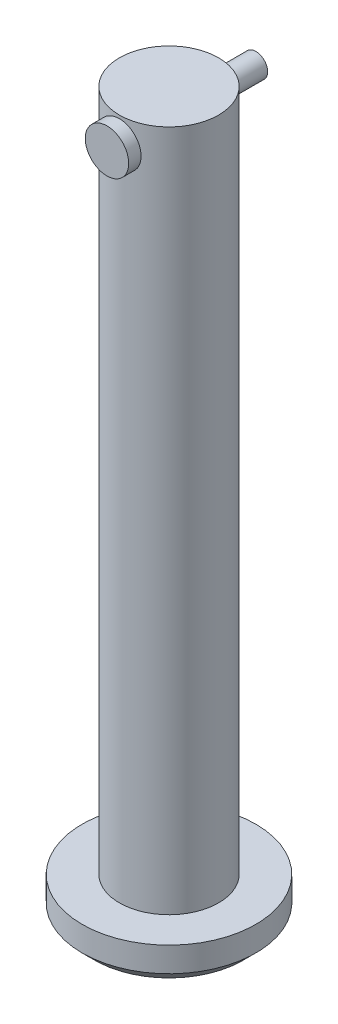
ISO-10303-21;
HEADER;
FILE_DESCRIPTION(('STEP AP214'),'2;1');
FILE_NAME('part.step','',(''),(''),'','','');
FILE_SCHEMA(('AUTOMOTIVE_DESIGN { 1 0 10303 214 1 1 1 1 }'));
ENDSEC;
DATA;
#1=APPLICATION_CONTEXT('core data for automotive mechanical design processes');
#2=APPLICATION_PROTOCOL_DEFINITION('international standard','automotive_design',2000,#1);
#3=PRODUCT_CONTEXT('',#1,'mechanical');
#4=PRODUCT('Part','Part','',(#3));
#5=PRODUCT_RELATED_PRODUCT_CATEGORY('part','',(#4));
#6=PRODUCT_DEFINITION_FORMATION('','',#4);
#7=PRODUCT_DEFINITION_CONTEXT('part definition',#1,'design');
#8=PRODUCT_DEFINITION('design','',#6,#7);
#9=PRODUCT_DEFINITION_SHAPE('','',#8);
#10=(LENGTH_UNIT() NAMED_UNIT(*) SI_UNIT(.MILLI.,.METRE.));
#11=(NAMED_UNIT(*) PLANE_ANGLE_UNIT() SI_UNIT($,.RADIAN.));
#12=(NAMED_UNIT(*) SI_UNIT($,.STERADIAN.) SOLID_ANGLE_UNIT());
#13=UNCERTAINTY_MEASURE_WITH_UNIT(LENGTH_MEASURE(1.E-05),#10,'distance_accuracy_value','');
#14=(GEOMETRIC_REPRESENTATION_CONTEXT(3) GLOBAL_UNCERTAINTY_ASSIGNED_CONTEXT((#13)) GLOBAL_UNIT_ASSIGNED_CONTEXT((#10,
#11,#12)) REPRESENTATION_CONTEXT('',''));
#15=CARTESIAN_POINT('',(0.,0.,0.));
#16=DIRECTION('',(0.,0.,1.));
#17=DIRECTION('',(1.,0.,0.));
#18=AXIS2_PLACEMENT_3D('',#15,#16,#17);
#19=CARTESIAN_POINT('',(0.,53.,-7.));
#20=DIRECTION('',(0.,0.,1.));
#21=DIRECTION('',(1.,0.,0.));
#22=AXIS2_PLACEMENT_3D('',#19,#20,#21);
#23=CYLINDRICAL_SURFACE('',#22,0.95);
#24=CARTESIAN_POINT('',(0.,53.,-7.));
#25=DIRECTION('',(0.,0.,1.));
#26=DIRECTION('',(1.,0.,0.));
#27=AXIS2_PLACEMENT_3D('',#24,#25,#26);
#28=CIRCLE('',#27,0.95);
#29=CARTESIAN_POINT('',(0.95,53.,-7.));
#30=VERTEX_POINT('',#29);
#31=EDGE_CURVE('E11',#30,#30,#28,.T.);
#32=ORIENTED_EDGE('',*,*,#31,.T.);
#33=EDGE_LOOP('',(#32));
#34=FACE_BOUND('',#33,.T.);
#35=CARTESIAN_POINT('',(0.,53.,4.));
#36=DIRECTION('',(0.,0.,1.));
#37=DIRECTION('',(1.,0.,0.));
#38=AXIS2_PLACEMENT_3D('',#35,#36,#37);
#39=CIRCLE('',#38,0.95);
#40=CARTESIAN_POINT('',(0.95,53.,4.));
#41=VERTEX_POINT('',#40);
#42=EDGE_CURVE('E42',#41,#41,#39,.F.);
#43=ORIENTED_EDGE('',*,*,#42,.T.);
#44=EDGE_LOOP('',(#43));
#45=FACE_BOUND('',#44,.T.);
#46=ADVANCED_FACE('F39',(#34,#45),#23,.T.);
#47=CARTESIAN_POINT('',(0.,53.,-7.));
#48=DIRECTION('',(0.,0.,1.));
#49=DIRECTION('',(1.,0.,0.));
#50=AXIS2_PLACEMENT_3D('',#47,#48,#49);
#51=PLANE('',#50);
#52=ORIENTED_EDGE('',*,*,#31,.F.);
#53=EDGE_LOOP('',(#52));
#54=FACE_BOUND('',#53,.T.);
#55=ADVANCED_FACE('F71',(#54),#51,.F.);
#56=CARTESIAN_POINT('',(0.,53.,4.));
#57=DIRECTION('',(0.,0.,1.));
#58=DIRECTION('',(1.,0.,0.));
#59=AXIS2_PLACEMENT_3D('',#56,#57,#58);
#60=CYLINDRICAL_SURFACE('',#59,1.75);
#61=CARTESIAN_POINT('',(0.,53.,4.));
#62=DIRECTION('',(0.,0.,1.));
#63=DIRECTION('',(1.,0.,0.));
#64=AXIS2_PLACEMENT_3D('',#61,#62,#63);
#65=CIRCLE('',#64,1.75);
#66=CARTESIAN_POINT('',(1.75,53.,4.));
#67=VERTEX_POINT('',#66);
#68=EDGE_CURVE('E49',#67,#67,#65,.T.);
#69=ORIENTED_EDGE('',*,*,#68,.T.);
#70=EDGE_LOOP('',(#69));
#71=FACE_BOUND('',#70,.T.);
#72=CARTESIAN_POINT('',(0.,53.,5.));
#73=DIRECTION('',(0.,0.,1.));
#74=DIRECTION('',(1.,0.,0.));
#75=AXIS2_PLACEMENT_3D('',#72,#73,#74);
#76=CIRCLE('',#75,1.75);
#77=CARTESIAN_POINT('',(1.75,53.,5.));
#78=VERTEX_POINT('',#77);
#79=EDGE_CURVE('E51',#78,#78,#76,.T.);
#80=ORIENTED_EDGE('',*,*,#79,.F.);
#81=EDGE_LOOP('',(#80));
#82=FACE_BOUND('',#81,.T.);
#83=ADVANCED_FACE('F57',(#71,#82),#60,.T.);
#84=CARTESIAN_POINT('',(0.,53.,4.));
#85=DIRECTION('',(0.,0.,1.));
#86=DIRECTION('',(1.,0.,0.));
#87=AXIS2_PLACEMENT_3D('',#84,#85,#86);
#88=PLANE('',#87);
#89=ORIENTED_EDGE('',*,*,#42,.F.);
#90=EDGE_LOOP('',(#89));
#91=FACE_BOUND('',#90,.T.);
#92=ORIENTED_EDGE('',*,*,#68,.F.);
#93=EDGE_LOOP('',(#92));
#94=FACE_BOUND('',#93,.T.);
#95=ADVANCED_FACE('F60',(#91,#94),#88,.F.);
#96=CARTESIAN_POINT('',(0.,53.,5.));
#97=DIRECTION('',(0.,0.,1.));
#98=DIRECTION('',(1.,0.,0.));
#99=AXIS2_PLACEMENT_3D('',#96,#97,#98);
#100=PLANE('',#99);
#101=ORIENTED_EDGE('',*,*,#79,.T.);
#102=EDGE_LOOP('',(#101));
#103=FACE_BOUND('',#102,.T.);
#104=ADVANCED_FACE('F62',(#103),#100,.T.);
#105=CLOSED_SHELL('',(#46,#55,#83,#95,#104));
#106=MANIFOLD_SOLID_BREP('B2',#105);
#107=CARTESIAN_POINT('',(0.,55.,0.));
#108=DIRECTION('',(0.,-1.,0.));
#109=DIRECTION('',(0.,0.,-1.));
#110=AXIS2_PLACEMENT_3D('',#107,#108,#109);
#111=CYLINDRICAL_SURFACE('',#110,4.);
#112=CARTESIAN_POINT('',(0.,55.,0.));
#113=DIRECTION('',(0.,1.,0.));
#114=DIRECTION('',(0.,0.,1.));
#115=AXIS2_PLACEMENT_3D('',#112,#113,#114);
#116=CIRCLE('',#115,4.);
#117=CARTESIAN_POINT('',(0.,55.,4.));
#118=VERTEX_POINT('',#117);
#119=EDGE_CURVE('E129',#118,#118,#116,.T.);
#120=ORIENTED_EDGE('',*,*,#119,.F.);
#121=EDGE_LOOP('',(#120));
#122=FACE_BOUND('',#121,.T.);
#123=CARTESIAN_POINT('',(0.,0.,0.));
#124=DIRECTION('',(0.,-1.,0.));
#125=DIRECTION('',(0.,0.,-1.));
#126=AXIS2_PLACEMENT_3D('',#123,#124,#125);
#127=CIRCLE('',#126,4.);
#128=CARTESIAN_POINT('',(0.,0.,-4.));
#129=VERTEX_POINT('',#128);
#130=EDGE_CURVE('E163',#129,#129,#127,.T.);
#131=ORIENTED_EDGE('',*,*,#130,.F.);
#132=EDGE_LOOP('',(#131));
#133=FACE_BOUND('',#132,.T.);
#134=CARTESIAN_POINT('',(-1.,53.,3.87298334620742));
#135=CARTESIAN_POINT('',(-0.9999984314387,52.9447796996432,3.87298440057185));
#136=CARTESIAN_POINT('',(-0.99541049820807,52.8895420405686,3.87417722499278));
#137=CARTESIAN_POINT('',(-0.977209250194447,52.7806529687674,3.87880744892249));
#138=CARTESIAN_POINT('',(-0.963590682698079,52.72700249822,3.8822461547418));
#139=CARTESIAN_POINT('',(-0.927796479849636,52.6228785847122,3.89095489813012));
#140=CARTESIAN_POINT('',(-0.905631891140943,52.5724011378422,3.8962225706936));
#141=CARTESIAN_POINT('',(-0.853408456505406,52.4758756589875,3.90799276818327));
#142=CARTESIAN_POINT('',(-0.823349275424505,52.4298278151688,3.91449534553241));
#143=CARTESIAN_POINT('',(-0.755483370924518,52.3424553418942,3.92816286540368));
#144=CARTESIAN_POINT('',(-0.717534755081557,52.3012425598597,3.93533839048709));
#145=CARTESIAN_POINT('',(-0.635272825640328,52.2256954422561,3.94945150206622));
#146=CARTESIAN_POINT('',(-0.590958917672139,52.1913617497514,3.95638906626691));
#147=CARTESIAN_POINT('',(-0.496458080431566,52.1300898129474,3.96936166208095));
#148=CARTESIAN_POINT('',(-0.446197830478046,52.1032614447354,3.975382749602));
#149=CARTESIAN_POINT('',(-0.341705273717113,52.0584761423388,3.9857232477043));
#150=CARTESIAN_POINT('',(-0.28747355431678,52.0405178992338,3.99004290933747));
#151=CARTESIAN_POINT('',(-0.177743503501666,52.0143408661686,3.99641903539262));
#152=CARTESIAN_POINT('',(-0.122293087819593,52.0059321422694,3.99851957537723));
#153=CARTESIAN_POINT('',(-0.0107315277051121,51.9984966482898,4.00037437642922));
#154=CARTESIAN_POINT('',(0.0453795178152232,51.9994684911162,4.00012898438682));
#155=CARTESIAN_POINT('',(0.155352247172384,52.0106299401001,3.99735237981413));
#156=CARTESIAN_POINT('',(0.209236215601064,52.0206145300215,3.99487200936349));
#157=CARTESIAN_POINT('',(0.314538247413684,52.0491885080194,3.98796334609942));
#158=CARTESIAN_POINT('',(0.365956179370436,52.067778354151,3.98353494959376));
#159=CARTESIAN_POINT('',(0.465406703501804,52.1132010282748,3.97315003880358));
#160=CARTESIAN_POINT('',(0.513404509766502,52.1401068178647,3.96718007878021));
#161=CARTESIAN_POINT('',(0.604275622340486,52.2013422716465,3.9543596152386));
#162=CARTESIAN_POINT('',(0.647148035085502,52.2356732274242,3.94750895860996));
#163=CARTESIAN_POINT('',(0.727774035084953,52.3118834967929,3.93345485507808));
#164=CARTESIAN_POINT('',(0.765357679075196,52.3539419569391,3.92624687810367));
#165=CARTESIAN_POINT('',(0.832976375963017,52.4438399894161,3.91246017406683));
#166=CARTESIAN_POINT('',(0.863011076046016,52.4916798317964,3.90588147642388));
#167=CARTESIAN_POINT('',(0.914788129022599,52.5921160136596,3.89408198732659));
#168=CARTESIAN_POINT('',(0.936489566970492,52.6447342921253,3.88886793490288));
#169=CARTESIAN_POINT('',(0.970685620636342,52.7530341872306,3.88047456055983));
#170=CARTESIAN_POINT('',(0.983182206552911,52.8087151455933,3.87729480324087));
#171=CARTESIAN_POINT('',(0.998331855466071,52.9199838006093,3.87342142415656));
#172=CARTESIAN_POINT('',(1.00123618956785,52.9755351173319,3.87266435637459));
#173=CARTESIAN_POINT('',(0.99780679620622,53.0863287746313,3.87354937392416));
#174=CARTESIAN_POINT('',(0.991473919139521,53.1415711431805,3.87519123840506));
#175=CARTESIAN_POINT('',(0.969970185575066,53.2492457059819,3.88062832781824));
#176=CARTESIAN_POINT('',(0.9549456273127,53.3017090906283,3.8843878809375));
#177=CARTESIAN_POINT('',(0.916647232668251,53.4033725831407,3.89360287308385));
#178=CARTESIAN_POINT('',(0.89337241908502,53.4525723036221,3.89905851299445));
#179=CARTESIAN_POINT('',(0.838708267174625,53.5473765111469,3.91118454837305));
#180=CARTESIAN_POINT('',(0.807168701534254,53.5928915360172,3.91787667442657));
#181=CARTESIAN_POINT('',(0.737060292934458,53.6780753451205,3.93166833228686));
#182=CARTESIAN_POINT('',(0.698490294805439,53.71774316666,3.93876793091388));
#183=CARTESIAN_POINT('',(0.614262720984725,53.7911244170284,3.95278961212642));
#184=CARTESIAN_POINT('',(0.568451952531594,53.8246640250195,3.95970280824734));
#185=CARTESIAN_POINT('',(0.47170268269468,53.8835743467805,3.97238886645493));
#186=CARTESIAN_POINT('',(0.420764448957596,53.9089454866433,3.97816178801584));
#187=CARTESIAN_POINT('',(0.315558201731095,53.9505784138112,3.98788046295326));
#188=CARTESIAN_POINT('',(0.261317381027885,53.9669057137516,3.99183932008964));
#189=CARTESIAN_POINT('',(0.15074976031881,53.9901841338434,3.99754117358315));
#190=CARTESIAN_POINT('',(0.0944233650412455,53.9971370634956,3.99928459757363));
#191=CARTESIAN_POINT('',(-0.0170835264433243,54.0013675895755,4.00034169408811));
#192=CARTESIAN_POINT('',(-0.0722538269660306,53.9989017090954,3.99971978880008));
#193=CARTESIAN_POINT('',(-0.181367496414737,53.9849521727057,3.99625896457423));
#194=CARTESIAN_POINT('',(-0.235310901780884,53.9734687849869,3.99342011157095));
#195=CARTESIAN_POINT('',(-0.340171035644813,53.9419477802291,3.98585432853963));
#196=CARTESIAN_POINT('',(-0.391102494581015,53.9219565466854,3.98113764502669));
#197=CARTESIAN_POINT('',(-0.488917053041464,53.8740294209807,3.97031288913382));
#198=CARTESIAN_POINT('',(-0.535799641265047,53.8460925273304,3.96420464137727));
#199=CARTESIAN_POINT('',(-0.625401928423897,53.7822847660029,3.95107249681342));
#200=CARTESIAN_POINT('',(-0.667994988300583,53.7462398570926,3.94403016945647));
#201=CARTESIAN_POINT('',(-0.746615020271249,53.6675771480262,3.92990649053207));
#202=CARTESIAN_POINT('',(-0.782640325068177,53.6249576839021,3.92282512952424));
#203=CARTESIAN_POINT('',(-0.84776202647924,53.5333985857987,3.90927475860683));
#204=CARTESIAN_POINT('',(-0.876716619446592,53.4843558765875,3.90281963730391));
#205=CARTESIAN_POINT('',(-0.925926896615621,53.3819445100772,3.8914395555011));
#206=CARTESIAN_POINT('',(-0.946188909759556,53.3285790338927,3.88651348244814));
#207=CARTESIAN_POINT('',(-0.974422528565572,53.2294229881737,3.87951908741315));
#208=CARTESIAN_POINT('',(-0.983993170595829,53.1841068356176,3.87708663005761));
#209=CARTESIAN_POINT('',(-0.996782292572819,53.0925311309985,3.87381838580358));
#210=CARTESIAN_POINT('',(-1.00000131437052,53.0462716597494,3.87298246270639));
#211=CARTESIAN_POINT('',(-1.,53.,3.87298334620742));
#212=B_SPLINE_CURVE_WITH_KNOTS('',3,(#134,#135,#136,#137,#138,#139,#140,#141,#142,#143,#144,
#145,#146,#147,#148,#149,#150,#151,#152,#153,#154,#155,#156,#157,#158,#159,#160,#161,#162,#163,
#164,#165,#166,#167,#168,#169,#170,#171,#172,#173,#174,#175,#176,#177,#178,#179,#180,#181,#182,
#183,#184,#185,#186,#187,#188,#189,#190,#191,#192,#193,#194,#195,#196,#197,#198,#199,#200,#201,
#202,#203,#204,#205,#206,#207,#208,#209,#210,#211),.UNSPECIFIED.,.T.,.F.,(4,2,2,2,2,2,2,2,2,2,2,
2,2,2,2,2,2,2,2,2,2,2,2,2,2,2,2,2,2,2,2,2,2,2,2,2,2,2,4),(0.,0.165490976675223,
0.331078296534208,0.496452290829153,0.66183330698466,0.830495816734648,0.99917408588221,
1.17020598555442,1.34121263935111,1.50875500394413,1.67627259462682,1.84007305071853,
2.00388222686189,2.16917149698052,2.3344895418384,2.50428186625038,2.67408212476195,
2.84470572799635,3.01529280048094,3.18137429900961,3.34744050869795,3.51078961999957,
3.67415808564842,3.84073138339937,4.00733207550293,4.17810132382402,4.34886166284095,
4.51836829119046,4.6878421955989,4.85273378447257,5.01762046947067,5.18161950620159,
5.34563922291503,5.51358838629103,5.68158012622478,5.85270590910146,6.02370688542922,
6.16239130867207,6.30106390036083),.UNSPECIFIED.);
#213=CARTESIAN_POINT('',(-1.,53.,3.87298334620742));
#214=VERTEX_POINT('',#213);
#215=EDGE_CURVE('E132',#214,#214,#212,.T.);
#216=ORIENTED_EDGE('',*,*,#215,.F.);
#217=EDGE_LOOP('',(#216));
#218=FACE_BOUND('',#217,.T.);
#219=CARTESIAN_POINT('',(0.,54.,-4.));
#220=CARTESIAN_POINT('',(0.0552507257798204,53.9999984495079,-3.99999906578675));
#221=CARTESIAN_POINT('',(0.110518771887175,53.9954056328175,-3.99884385421219));
#222=CARTESIAN_POINT('',(0.219470882513688,53.977183232462,-3.99434742553262));
#223=CARTESIAN_POINT('',(0.273154031247158,53.9635485269748,-3.99100496946646));
#224=CARTESIAN_POINT('',(0.377347248121717,53.9277071643586,-3.98250417554693));
#225=CARTESIAN_POINT('',(0.427861042286668,53.9055108008565,-3.97734801894725));
#226=CARTESIAN_POINT('',(0.524448087936283,53.8532124066368,-3.96576895871729));
#227=CARTESIAN_POINT('',(0.570521189565837,53.823110109254,-3.95934601236034));
#228=CARTESIAN_POINT('',(0.657867951533944,53.7551994735639,-3.94578275727868));
#229=CARTESIAN_POINT('',(0.699037126707379,53.7172589500272,-3.93863138099022));
#230=CARTESIAN_POINT('',(0.774499284802203,53.6350318633941,-3.92449080078353));
#231=CARTESIAN_POINT('',(0.808791491299424,53.5907445847023,-3.91750161525566));
#232=CARTESIAN_POINT('',(0.870017695199355,53.4962698488417,-3.9043651713314));
#233=CARTESIAN_POINT('',(0.896834810616904,53.4460045127931,-3.89823196313737));
#234=CARTESIAN_POINT('',(0.941597939033684,53.3415010588944,-3.88766329874815));
#235=CARTESIAN_POINT('',(0.959545370292888,53.2872635777828,-3.88322757115193));
#236=CARTESIAN_POINT('',(0.985703224536194,53.1775043345317,-3.87666984478367));
#237=CARTESIAN_POINT('',(0.994101512222226,53.1220300693001,-3.87450327383617));
#238=CARTESIAN_POINT('',(1.00150785004524,53.0104209539907,-3.8725957502516));
#239=CARTESIAN_POINT('',(1.00051742787865,52.9542862128676,-3.87285440299096));
#240=CARTESIAN_POINT('',(0.989324349759521,52.8443894615037,-3.87572803664412));
#241=CARTESIAN_POINT('',(0.979345560127013,52.7906029190233,-3.87828575334586));
#242=CARTESIAN_POINT('',(0.950816124602072,52.6854926327258,-3.88537806450989));
#243=CARTESIAN_POINT('',(0.932264868046283,52.6341690646473,-3.88991279980464));
#244=CARTESIAN_POINT('',(0.886926318624771,52.5348413224986,-3.90050075936124));
#245=CARTESIAN_POINT('',(0.860057778155276,52.4868758854736,-3.90656884979614));
#246=CARTESIAN_POINT('',(0.798904184009972,52.3960541934954,-3.91953140564257));
#247=CARTESIAN_POINT('',(0.764617832539228,52.3531988346218,-3.9264260155649));
#248=CARTESIAN_POINT('',(0.688442283120814,52.2725309228704,-3.94050587026521));
#249=CARTESIAN_POINT('',(0.646364172110576,52.2348970066258,-3.94769379651981));
#250=CARTESIAN_POINT('',(0.55640794500247,52.1671858383574,-3.96137310385857));
#251=CARTESIAN_POINT('',(0.5085296518053,52.1371088171576,-3.96786446366277));
#252=CARTESIAN_POINT('',(0.408077259120932,52.0852996091837,-3.97945154729455));
#253=CARTESIAN_POINT('',(0.355487595472419,52.0635964398304,-3.9845424008515));
#254=CARTESIAN_POINT('',(0.247250672095257,52.0293884628603,-3.99271944660946));
#255=CARTESIAN_POINT('',(0.191603999433657,52.0168818957212,-3.99580602226187));
#256=CARTESIAN_POINT('',(0.0803599802600167,52.0016949562941,-3.9995699951425));
#257=CARTESIAN_POINT('',(0.0247978133254724,51.9987713159498,-4.00030702338852));
#258=CARTESIAN_POINT('',(-0.0860219165343387,52.0021660013703,-3.999458698763));
#259=CARTESIAN_POINT('',(-0.141279506429729,52.0084834951994,-3.99787355494564));
#260=CARTESIAN_POINT('',(-0.249076179184327,52.0299806055943,-3.99259720751571));
#261=CARTESIAN_POINT('',(-0.301643412645836,52.0450275089847,-3.98893756123874));
#262=CARTESIAN_POINT('',(-0.403504861635007,52.0834047226856,-3.97992471089423));
#263=CARTESIAN_POINT('',(-0.452798746021756,52.1067358695421,-3.97457133579928));
#264=CARTESIAN_POINT('',(-0.547682089619897,52.1614907525831,-3.96262205284207));
#265=CARTESIAN_POINT('',(-0.593190294557219,52.1930507415978,-3.95600578244621));
#266=CARTESIAN_POINT('',(-0.678351075762164,52.2631932725313,-3.94229672791613));
#267=CARTESIAN_POINT('',(-0.718002639315339,52.3017770264113,-3.93520386167803));
#268=CARTESIAN_POINT('',(-0.79132704538182,52.3860013072296,-3.92112637973847));
#269=CARTESIAN_POINT('',(-0.824829245081354,52.4317918020016,-3.91414869458187));
#270=CARTESIAN_POINT('',(-0.883673839341797,52.5284884229771,-3.90128585584826));
#271=CARTESIAN_POINT('',(-0.90901659610529,52.5793943219732,-3.89540065378017));
#272=CARTESIAN_POINT('',(-0.950634280406194,52.684603814942,-3.88545396489777));
#273=CARTESIAN_POINT('',(-0.966962931102709,52.7388850855627,-3.88138170194604));
#274=CARTESIAN_POINT('',(-0.990230439969185,52.8495397585927,-3.87551162726789));
#275=CARTESIAN_POINT('',(-0.997171351652439,52.9059127006883,-3.87371331813291));
#276=CARTESIAN_POINT('',(-1.00135906022266,53.0174140159035,-3.87263267469304));
#277=CARTESIAN_POINT('',(-0.99887859852008,53.0725316234165,-3.87327955152176));
#278=CARTESIAN_POINT('',(-0.984918185541912,53.1815359257786,-3.87685272671895));
#279=CARTESIAN_POINT('',(-0.973438415124513,53.2354226453424,-3.87977897927904));
#280=CARTESIAN_POINT('',(-0.941954212961865,53.3401389727103,-3.88754173788482));
#281=CARTESIAN_POINT('',(-0.922000936453587,53.3909848701601,-3.89236676824206));
#282=CARTESIAN_POINT('',(-0.874176609070051,53.4886435884758,-3.90338503816552));
#283=CARTESIAN_POINT('',(-0.846304460022794,53.5354558487913,-3.90957846747182));
#284=CARTESIAN_POINT('',(-0.782578499091424,53.6250364193347,-3.92283756175675));
#285=CARTESIAN_POINT('',(-0.746535441941502,53.6676673822826,-3.92992176554505));
#286=CARTESIAN_POINT('',(-0.667859580793156,53.7463646965303,-3.94405351497524));
#287=CARTESIAN_POINT('',(-0.625225214174096,53.782429486742,-3.95110105151373));
#288=CARTESIAN_POINT('',(-0.533645057801726,53.8476075390431,-3.96451770431775));
#289=CARTESIAN_POINT('',(-0.484598948210924,53.8765830757811,-3.97087222243912));
#290=CARTESIAN_POINT('',(-0.382177373006984,53.9258316419604,-3.98203283316746));
#291=CARTESIAN_POINT('',(-0.32880504229116,53.946110907099,-3.98684003466521));
#292=CARTESIAN_POINT('',(-0.229606835495648,53.9743812202198,-3.99365373043694));
#293=CARTESIAN_POINT('',(-0.184253447272045,53.983967495369,-3.9960172336846));
#294=CARTESIAN_POINT('',(-0.0926040476908547,53.996777295748,-3.99919070154632));
#295=CARTESIAN_POINT('',(-0.0463081074950772,54.0000012995369,-4.00000078300596));
#296=CARTESIAN_POINT('',(0.,54.,-4.));
#297=B_SPLINE_CURVE_WITH_KNOTS('',3,(#219,#220,#221,#222,#223,#224,#225,#226,#227,#228,#229,
#230,#231,#232,#233,#234,#235,#236,#237,#238,#239,#240,#241,#242,#243,#244,#245,#246,#247,#248,
#249,#250,#251,#252,#253,#254,#255,#256,#257,#258,#259,#260,#261,#262,#263,#264,#265,#266,#267,
#268,#269,#270,#271,#272,#273,#274,#275,#276,#277,#278,#279,#280,#281,#282,#283,#284,#285,#286,
#287,#288,#289,#290,#291,#292,#293,#294,#295,#296),.UNSPECIFIED.,.T.,.F.,(4,2,2,2,2,2,2,2,2,2,2,
2,2,2,2,2,2,2,2,2,2,2,2,2,2,2,2,2,2,2,2,2,2,2,2,2,2,2,4),(0.,0.165582474981259,
0.331258825175933,0.496736601524068,0.662219960112883,0.830762902914257,0.99932486386708,
1.17039098363871,1.34142974112912,1.50904196732954,1.67662692075131,1.84014998004678,
2.00368468977359,2.16887018582586,2.33408460557442,2.50401000646013,2.67394059705498,
2.84445486006076,3.01493649125762,3.18105539299518,3.34715934075162,3.51080183009358,
3.67446084881527,3.84102391710234,4.00761575338679,4.17829672802984,4.34897012499671,
4.51861503076024,4.68822282168272,4.85295853599075,5.01769093970689,5.18144267039631,
5.34521712091267,5.51326384273274,5.68135046513612,5.85248123666392,6.02348909214233,
6.16228161961433,6.3010637069536),.UNSPECIFIED.);
#298=CARTESIAN_POINT('',(0.,54.,-4.));
#299=VERTEX_POINT('',#298);
#300=EDGE_CURVE('E117',#299,#299,#297,.T.);
#301=ORIENTED_EDGE('',*,*,#300,.F.);
#302=EDGE_LOOP('',(#301));
#303=FACE_BOUND('',#302,.T.);
#304=ADVANCED_FACE('F113',(#122,#133,#218,#303),#111,.T.);
#305=CARTESIAN_POINT('',(0.,55.,0.));
#306=DIRECTION('',(0.,1.,0.));
#307=DIRECTION('',(0.,0.,1.));
#308=AXIS2_PLACEMENT_3D('',#305,#306,#307);
#309=PLANE('',#308);
#310=ORIENTED_EDGE('',*,*,#119,.T.);
#311=EDGE_LOOP('',(#310));
#312=FACE_BOUND('',#311,.T.);
#313=ADVANCED_FACE('F154',(#312),#309,.T.);
#314=CARTESIAN_POINT('',(0.,-3.,0.));
#315=DIRECTION('',(0.,1.,0.));
#316=DIRECTION('',(0.,0.,1.));
#317=AXIS2_PLACEMENT_3D('',#314,#315,#316);
#318=CYLINDRICAL_SURFACE('',#317,7.);
#319=CARTESIAN_POINT('',(0.,-1.99999999999999,0.));
#320=DIRECTION('',(0.,-1.,0.));
#321=DIRECTION('',(0.,0.,-1.));
#322=AXIS2_PLACEMENT_3D('',#319,#320,#321);
#323=CIRCLE('',#322,7.);
#324=CARTESIAN_POINT('',(0.,-1.99999999999999,-7.));
#325=VERTEX_POINT('',#324);
#326=EDGE_CURVE('E38',#325,#325,#323,.F.);
#327=ORIENTED_EDGE('',*,*,#326,.T.);
#328=EDGE_LOOP('',(#327));
#329=FACE_BOUND('',#328,.T.);
#330=CARTESIAN_POINT('',(0.,0.,0.));
#331=DIRECTION('',(0.,-1.,0.));
#332=DIRECTION('',(0.,0.,-1.));
#333=AXIS2_PLACEMENT_3D('',#330,#331,#332);
#334=CIRCLE('',#333,7.);
#335=CARTESIAN_POINT('',(0.,0.,-7.));
#336=VERTEX_POINT('',#335);
#337=EDGE_CURVE('E165',#336,#336,#334,.T.);
#338=ORIENTED_EDGE('',*,*,#337,.T.);
#339=EDGE_LOOP('',(#338));
#340=FACE_BOUND('',#339,.T.);
#341=ADVANCED_FACE('F148',(#329,#340),#318,.T.);
#342=CARTESIAN_POINT('',(0.,-3.,0.));
#343=DIRECTION('',(0.,-1.,0.));
#344=DIRECTION('',(0.,0.,-1.));
#345=AXIS2_PLACEMENT_3D('',#342,#343,#344);
#346=PLANE('',#345);
#347=CARTESIAN_POINT('',(0.,-3.,0.));
#348=DIRECTION('',(0.,-1.,0.));
#349=DIRECTION('',(0.,0.,-1.));
#350=AXIS2_PLACEMENT_3D('',#347,#348,#349);
#351=CIRCLE('',#350,6.);
#352=CARTESIAN_POINT('',(0.,-3.,-6.));
#353=VERTEX_POINT('',#352);
#354=EDGE_CURVE('E124',#353,#353,#351,.T.);
#355=ORIENTED_EDGE('',*,*,#354,.T.);
#356=EDGE_LOOP('',(#355));
#357=FACE_BOUND('',#356,.T.);
#358=ADVANCED_FACE('F143',(#357),#346,.T.);
#359=CARTESIAN_POINT('',(0.,0.,0.));
#360=DIRECTION('',(0.,-1.,0.));
#361=DIRECTION('',(0.,0.,-1.));
#362=AXIS2_PLACEMENT_3D('',#359,#360,#361);
#363=PLANE('',#362);
#364=ORIENTED_EDGE('',*,*,#130,.T.);
#365=EDGE_LOOP('',(#364));
#366=FACE_BOUND('',#365,.T.);
#367=ORIENTED_EDGE('',*,*,#337,.F.);
#368=EDGE_LOOP('',(#367));
#369=FACE_BOUND('',#368,.T.);
#370=ADVANCED_FACE('F147',(#366,#369),#363,.F.);
#371=CARTESIAN_POINT('',(0.,-3.,0.));
#372=DIRECTION('',(0.,1.,0.));
#373=DIRECTION('',(0.,0.,1.));
#374=AXIS2_PLACEMENT_3D('',#371,#372,#373);
#375=CONICAL_SURFACE('',#374,6.,0.785398163397447);
#376=ORIENTED_EDGE('',*,*,#326,.F.);
#377=EDGE_LOOP('',(#376));
#378=FACE_BOUND('',#377,.T.);
#379=ORIENTED_EDGE('',*,*,#354,.F.);
#380=EDGE_LOOP('',(#379));
#381=FACE_BOUND('',#380,.T.);
#382=ADVANCED_FACE('F115',(#378,#381),#375,.T.);
#383=CARTESIAN_POINT('',(0.,53.,10.));
#384=DIRECTION('',(0.,0.,-1.));
#385=DIRECTION('',(-1.,0.,0.));
#386=AXIS2_PLACEMENT_3D('',#383,#384,#385);
#387=CYLINDRICAL_SURFACE('',#386,1.);
#388=ORIENTED_EDGE('',*,*,#215,.T.);
#389=EDGE_LOOP('',(#388));
#390=FACE_BOUND('',#389,.T.);
#391=ORIENTED_EDGE('',*,*,#300,.T.);
#392=EDGE_LOOP('',(#391));
#393=FACE_BOUND('',#392,.T.);
#394=ADVANCED_FACE('F138',(#390,#393),#387,.F.);
#395=CLOSED_SHELL('',(#304,#313,#341,#358,#370,#382,#394));
#396=MANIFOLD_SOLID_BREP('B6',#395);
#397=ADVANCED_BREP_SHAPE_REPRESENTATION('',(#18,#106,#396),#14);
#398=SHAPE_DEFINITION_REPRESENTATION(#9,#397);
ENDSEC;
END-ISO-10303-21;
